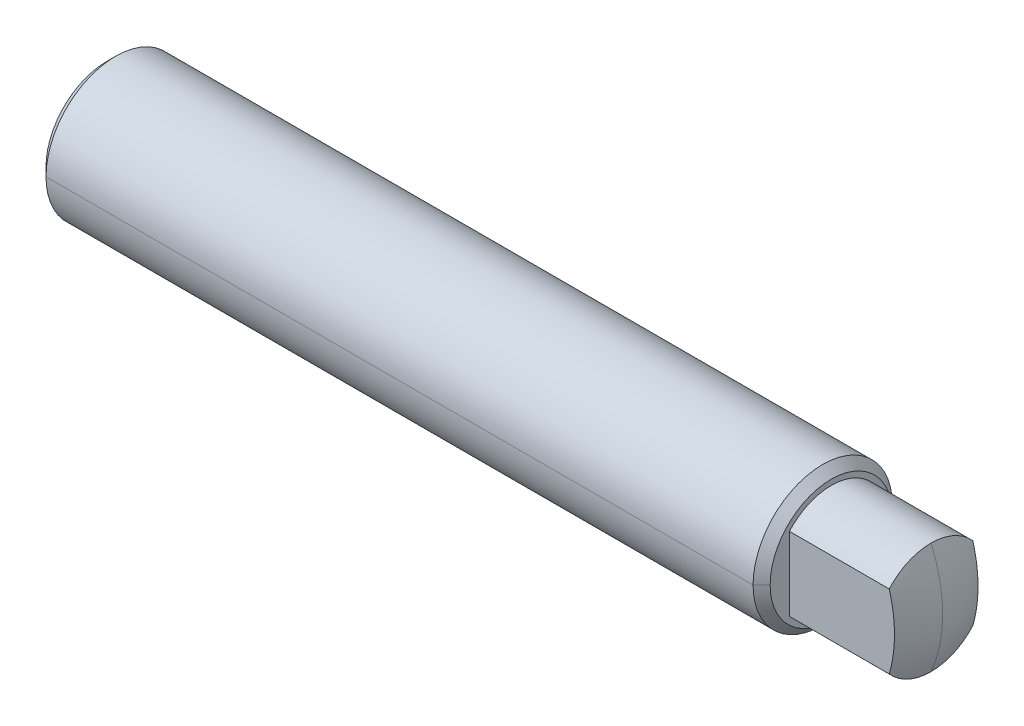
ISO-10303-21;
HEADER;
FILE_DESCRIPTION(('STEP AP214'),'2;1');
FILE_NAME('part.step','',(''),(''),'','','');
FILE_SCHEMA(('AUTOMOTIVE_DESIGN { 1 0 10303 214 1 1 1 1 }'));
ENDSEC;
DATA;
#1=APPLICATION_CONTEXT('core data for automotive mechanical design processes');
#2=APPLICATION_PROTOCOL_DEFINITION('international standard','automotive_design',2000,#1);
#3=PRODUCT_CONTEXT('',#1,'mechanical');
#4=PRODUCT('Part','Part','',(#3));
#5=PRODUCT_RELATED_PRODUCT_CATEGORY('part','',(#4));
#6=PRODUCT_DEFINITION_FORMATION('','',#4);
#7=PRODUCT_DEFINITION_CONTEXT('part definition',#1,'design');
#8=PRODUCT_DEFINITION('design','',#6,#7);
#9=PRODUCT_DEFINITION_SHAPE('','',#8);
#10=(LENGTH_UNIT() NAMED_UNIT(*) SI_UNIT(.MILLI.,.METRE.));
#11=(NAMED_UNIT(*) PLANE_ANGLE_UNIT() SI_UNIT($,.RADIAN.));
#12=(NAMED_UNIT(*) SI_UNIT($,.STERADIAN.) SOLID_ANGLE_UNIT());
#13=UNCERTAINTY_MEASURE_WITH_UNIT(LENGTH_MEASURE(1.E-05),#10,'distance_accuracy_value','');
#14=(GEOMETRIC_REPRESENTATION_CONTEXT(3) GLOBAL_UNCERTAINTY_ASSIGNED_CONTEXT((#13)) GLOBAL_UNIT_ASSIGNED_CONTEXT((#10,
#11,#12)) REPRESENTATION_CONTEXT('',''));
#15=CARTESIAN_POINT('',(0.,0.,0.));
#16=DIRECTION('',(0.,0.,1.));
#17=DIRECTION('',(1.,0.,0.));
#18=AXIS2_PLACEMENT_3D('',#15,#16,#17);
#19=CARTESIAN_POINT('',(60.,0.,0.));
#20=DIRECTION('',(1.,0.,0.));
#21=DIRECTION('',(0.,1.,0.));
#22=AXIS2_PLACEMENT_3D('',#19,#20,#21);
#23=CYLINDRICAL_SURFACE('',#22,4.);
#24=DIRECTION('',(-1.,0.,0.));
#25=VECTOR('',#24,1.);
#26=CARTESIAN_POINT('',(60.,-2.64575131106459,-3.));
#27=LINE('',#26,#25);
#28=CARTESIAN_POINT('',(59.165151389912,-2.64575131106579,-3.));
#29=VERTEX_POINT('',#28);
#30=CARTESIAN_POINT('',(52.,-2.64575131106459,-3.));
#31=VERTEX_POINT('',#30);
#32=EDGE_CURVE('E11',#29,#31,#27,.T.);
#33=ORIENTED_EDGE('',*,*,#32,.F.);
#34=CARTESIAN_POINT('',(59.165151389912,0.,0.));
#35=DIRECTION('',(1.,0.,0.));
#36=DIRECTION('',(0.,0.,-1.));
#37=AXIS2_PLACEMENT_3D('',#34,#35,#36);
#38=CIRCLE('',#37,4.);
#39=CARTESIAN_POINT('',(59.1651513899125,-4.00000000000056,0.));
#40=VERTEX_POINT('',#39);
#41=EDGE_CURVE('E24',#40,#29,#38,.T.);
#42=ORIENTED_EDGE('',*,*,#41,.F.);
#43=CARTESIAN_POINT('',(59.165151389912,0.,0.));
#44=DIRECTION('',(1.,0.,0.));
#45=DIRECTION('',(0.,0.,-1.));
#46=AXIS2_PLACEMENT_3D('',#43,#44,#45);
#47=CIRCLE('',#46,4.);
#48=CARTESIAN_POINT('',(59.165151389912,-2.64575131106579,3.));
#49=VERTEX_POINT('',#48);
#50=EDGE_CURVE('E155',#49,#40,#47,.T.);
#51=ORIENTED_EDGE('',*,*,#50,.F.);
#52=DIRECTION('',(1.,0.,0.));
#53=VECTOR('',#52,1.);
#54=CARTESIAN_POINT('',(60.,-2.64575131106459,3.));
#55=LINE('',#54,#53);
#56=CARTESIAN_POINT('',(52.,-2.64575131106459,3.));
#57=VERTEX_POINT('',#56);
#58=EDGE_CURVE('E411',#57,#49,#55,.T.);
#59=ORIENTED_EDGE('',*,*,#58,.F.);
#60=CARTESIAN_POINT('',(52.,0.,0.));
#61=DIRECTION('',(1.,0.,0.));
#62=DIRECTION('',(0.,0.,-1.));
#63=AXIS2_PLACEMENT_3D('',#60,#61,#62);
#64=CIRCLE('',#63,4.);
#65=EDGE_CURVE('E407',#57,#31,#64,.T.);
#66=ORIENTED_EDGE('',*,*,#65,.T.);
#67=EDGE_LOOP('',(#33,#42,#51,#59,#66));
#68=FACE_BOUND('',#67,.T.);
#69=ADVANCED_FACE('F16',(#68),#23,.T.);
#70=CARTESIAN_POINT('',(52.,4.3865,0.));
#71=DIRECTION('',(-1.,0.,0.));
#72=DIRECTION('',(0.,0.,1.));
#73=AXIS2_PLACEMENT_3D('',#70,#71,#72);
#74=PLANE('',#73);
#75=CARTESIAN_POINT('',(52.,0.,0.));
#76=DIRECTION('',(1.,0.,0.));
#77=DIRECTION('',(0.,0.,-1.));
#78=AXIS2_PLACEMENT_3D('',#75,#76,#77);
#79=CIRCLE('',#78,4.);
#80=CARTESIAN_POINT('',(52.,2.64575131106459,-3.));
#81=VERTEX_POINT('',#80);
#82=CARTESIAN_POINT('',(52.,2.64575131106459,3.));
#83=VERTEX_POINT('',#82);
#84=EDGE_CURVE('E402',#81,#83,#79,.T.);
#85=ORIENTED_EDGE('',*,*,#84,.F.);
#86=DIRECTION('',(0.,1.,0.));
#87=VECTOR('',#86,1.);
#88=CARTESIAN_POINT('',(52.,-10.,-3.));
#89=LINE('',#88,#87);
#90=EDGE_CURVE('E397',#31,#81,#89,.T.);
#91=ORIENTED_EDGE('',*,*,#90,.F.);
#92=ORIENTED_EDGE('',*,*,#65,.F.);
#93=DIRECTION('',(0.,-1.,0.));
#94=VECTOR('',#93,1.);
#95=CARTESIAN_POINT('',(52.,10.,3.));
#96=LINE('',#95,#94);
#97=EDGE_CURVE('E392',#83,#57,#96,.T.);
#98=ORIENTED_EDGE('',*,*,#97,.F.);
#99=EDGE_LOOP('',(#85,#91,#92,#98));
#100=FACE_BOUND('',#99,.T.);
#101=CARTESIAN_POINT('',(52.,0.,0.));
#102=DIRECTION('',(1.,0.,0.));
#103=DIRECTION('',(0.,0.,-1.));
#104=AXIS2_PLACEMENT_3D('',#101,#102,#103);
#105=CIRCLE('',#104,4.3865);
#106=CARTESIAN_POINT('',(52.,0.,-4.3865));
#107=VERTEX_POINT('',#106);
#108=CARTESIAN_POINT('',(52.,0.,4.3865));
#109=VERTEX_POINT('',#108);
#110=EDGE_CURVE('E388',#107,#109,#105,.T.);
#111=ORIENTED_EDGE('',*,*,#110,.T.);
#112=CARTESIAN_POINT('',(52.,0.,0.));
#113=DIRECTION('',(1.,0.,0.));
#114=DIRECTION('',(0.,0.,-1.));
#115=AXIS2_PLACEMENT_3D('',#112,#113,#114);
#116=CIRCLE('',#115,4.3865);
#117=EDGE_CURVE('E384',#109,#107,#116,.T.);
#118=ORIENTED_EDGE('',*,*,#117,.T.);
#119=EDGE_LOOP('',(#111,#118));
#120=FACE_BOUND('',#119,.T.);
#121=ADVANCED_FACE('F434',(#100,#120),#74,.F.);
#122=CARTESIAN_POINT('',(51.3865,0.,0.));
#123=DIRECTION('',(-1.,0.,0.));
#124=DIRECTION('',(0.,1.,0.));
#125=AXIS2_PLACEMENT_3D('',#122,#123,#124);
#126=CONICAL_SURFACE('',#125,5.,0.785398163397441);
#127=DIRECTION('',(-0.707106781186555,0.,-0.70710678118654));
#128=VECTOR('',#127,1.);
#129=CARTESIAN_POINT('',(52.,0.,-4.3865));
#130=LINE('',#129,#128);
#131=CARTESIAN_POINT('',(51.3865,0.,-5.));
#132=VERTEX_POINT('',#131);
#133=EDGE_CURVE('E379',#107,#132,#130,.T.);
#134=ORIENTED_EDGE('',*,*,#133,.F.);
#135=ORIENTED_EDGE('',*,*,#117,.F.);
#136=DIRECTION('',(-0.707106781186555,0.,0.70710678118654));
#137=VECTOR('',#136,1.);
#138=CARTESIAN_POINT('',(52.,0.,4.3865));
#139=LINE('',#138,#137);
#140=CARTESIAN_POINT('',(51.3865,0.,5.));
#141=VERTEX_POINT('',#140);
#142=EDGE_CURVE('E375',#109,#141,#139,.T.);
#143=ORIENTED_EDGE('',*,*,#142,.T.);
#144=CARTESIAN_POINT('',(51.3865,0.,0.));
#145=DIRECTION('',(1.,0.,0.));
#146=DIRECTION('',(0.,0.,-1.));
#147=AXIS2_PLACEMENT_3D('',#144,#145,#146);
#148=CIRCLE('',#147,5.);
#149=EDGE_CURVE('E371',#141,#132,#148,.T.);
#150=ORIENTED_EDGE('',*,*,#149,.T.);
#151=EDGE_LOOP('',(#134,#135,#143,#150));
#152=FACE_BOUND('',#151,.T.);
#153=ADVANCED_FACE('F437',(#152),#126,.T.);
#154=CARTESIAN_POINT('',(60.,0.,0.));
#155=DIRECTION('',(1.,0.,0.));
#156=DIRECTION('',(0.,1.,0.));
#157=AXIS2_PLACEMENT_3D('',#154,#155,#156);
#158=CYLINDRICAL_SURFACE('',#157,5.);
#159=DIRECTION('',(1.,0.,0.));
#160=VECTOR('',#159,1.);
#161=CARTESIAN_POINT('',(0.613500000000002,0.,5.));
#162=LINE('',#161,#160);
#163=CARTESIAN_POINT('',(0.613500000000001,0.,5.));
#164=VERTEX_POINT('',#163);
#165=EDGE_CURVE('E366',#164,#141,#162,.T.);
#166=ORIENTED_EDGE('',*,*,#165,.F.);
#167=CARTESIAN_POINT('',(0.6135,0.,0.));
#168=DIRECTION('',(1.,0.,0.));
#169=DIRECTION('',(0.,0.,-1.));
#170=AXIS2_PLACEMENT_3D('',#167,#168,#169);
#171=CIRCLE('',#170,5.);
#172=CARTESIAN_POINT('',(0.6135,0.,-5.));
#173=VERTEX_POINT('',#172);
#174=EDGE_CURVE('E362',#164,#173,#171,.T.);
#175=ORIENTED_EDGE('',*,*,#174,.T.);
#176=DIRECTION('',(1.,0.,0.));
#177=VECTOR('',#176,1.);
#178=CARTESIAN_POINT('',(0.613500000000002,0.,-5.));
#179=LINE('',#178,#177);
#180=EDGE_CURVE('E357',#173,#132,#179,.T.);
#181=ORIENTED_EDGE('',*,*,#180,.T.);
#182=ORIENTED_EDGE('',*,*,#149,.F.);
#183=EDGE_LOOP('',(#166,#175,#181,#182));
#184=FACE_BOUND('',#183,.T.);
#185=ADVANCED_FACE('F449',(#184),#158,.T.);
#186=CARTESIAN_POINT('',(60.,0.,0.));
#187=DIRECTION('',(1.,0.,0.));
#188=DIRECTION('',(0.,-1.,0.));
#189=AXIS2_PLACEMENT_3D('',#186,#187,#188);
#190=CYLINDRICAL_SURFACE('',#189,5.);
#191=ORIENTED_EDGE('',*,*,#165,.T.);
#192=CARTESIAN_POINT('',(51.3865,0.,0.));
#193=DIRECTION('',(1.,0.,0.));
#194=DIRECTION('',(0.,0.,-1.));
#195=AXIS2_PLACEMENT_3D('',#192,#193,#194);
#196=CIRCLE('',#195,5.);
#197=EDGE_CURVE('E352',#132,#141,#196,.T.);
#198=ORIENTED_EDGE('',*,*,#197,.F.);
#199=ORIENTED_EDGE('',*,*,#180,.F.);
#200=CARTESIAN_POINT('',(0.6135,0.,0.));
#201=DIRECTION('',(1.,0.,0.));
#202=DIRECTION('',(0.,0.,-1.));
#203=AXIS2_PLACEMENT_3D('',#200,#201,#202);
#204=CIRCLE('',#203,5.);
#205=EDGE_CURVE('E347',#173,#164,#204,.T.);
#206=ORIENTED_EDGE('',*,*,#205,.T.);
#207=EDGE_LOOP('',(#191,#198,#199,#206));
#208=FACE_BOUND('',#207,.T.);
#209=ADVANCED_FACE('F452',(#208),#190,.T.);
#210=CARTESIAN_POINT('',(0.,0.,0.));
#211=DIRECTION('',(1.,0.,0.));
#212=DIRECTION('',(0.,-1.,0.));
#213=AXIS2_PLACEMENT_3D('',#210,#211,#212);
#214=CONICAL_SURFACE('',#213,4.3865,0.785398163397446);
#215=DIRECTION('',(0.707106781186549,0.,0.707106781186546));
#216=VECTOR('',#215,1.);
#217=CARTESIAN_POINT('',(0.,0.,4.3865));
#218=LINE('',#217,#216);
#219=CARTESIAN_POINT('',(0.,0.,4.3865));
#220=VERTEX_POINT('',#219);
#221=EDGE_CURVE('E342',#220,#164,#218,.T.);
#222=ORIENTED_EDGE('',*,*,#221,.T.);
#223=ORIENTED_EDGE('',*,*,#205,.F.);
#224=DIRECTION('',(0.707106781186549,0.,-0.707106781186546));
#225=VECTOR('',#224,1.);
#226=CARTESIAN_POINT('',(0.,0.,-4.3865));
#227=LINE('',#226,#225);
#228=CARTESIAN_POINT('',(0.,0.,-4.3865));
#229=VERTEX_POINT('',#228);
#230=EDGE_CURVE('E337',#229,#173,#227,.T.);
#231=ORIENTED_EDGE('',*,*,#230,.F.);
#232=CARTESIAN_POINT('',(0.,0.,0.));
#233=DIRECTION('',(1.,0.,0.));
#234=DIRECTION('',(0.,0.,-1.));
#235=AXIS2_PLACEMENT_3D('',#232,#233,#234);
#236=CIRCLE('',#235,4.3865);
#237=EDGE_CURVE('E333',#229,#220,#236,.T.);
#238=ORIENTED_EDGE('',*,*,#237,.T.);
#239=EDGE_LOOP('',(#222,#223,#231,#238));
#240=FACE_BOUND('',#239,.T.);
#241=ADVANCED_FACE('F456',(#240),#214,.T.);
#242=CARTESIAN_POINT('',(0.,0.,0.));
#243=DIRECTION('',(1.,0.,0.));
#244=DIRECTION('',(0.,0.,-1.));
#245=AXIS2_PLACEMENT_3D('',#242,#243,#244);
#246=PLANE('',#245);
#247=CARTESIAN_POINT('',(0.,0.,0.));
#248=DIRECTION('',(1.,0.,0.));
#249=DIRECTION('',(0.,0.,-1.));
#250=AXIS2_PLACEMENT_3D('',#247,#248,#249);
#251=CIRCLE('',#250,4.3865);
#252=EDGE_CURVE('E328',#220,#229,#251,.T.);
#253=ORIENTED_EDGE('',*,*,#252,.F.);
#254=ORIENTED_EDGE('',*,*,#237,.F.);
#255=EDGE_LOOP('',(#253,#254));
#256=FACE_BOUND('',#255,.T.);
#257=DIRECTION('',(0.,0.499999999999983,-0.866025403784448));
#258=VECTOR('',#257,1.);
#259=CARTESIAN_POINT('',(0.,-2.8867513459481,0.));
#260=LINE('',#259,#258);
#261=CARTESIAN_POINT('',(0.,-2.8867513459481,0.));
#262=VERTEX_POINT('',#261);
#263=CARTESIAN_POINT('',(0.,-1.4433756729741,-2.5));
#264=VERTEX_POINT('',#263);
#265=EDGE_CURVE('E324',#262,#264,#260,.T.);
#266=ORIENTED_EDGE('',*,*,#265,.T.);
#267=DIRECTION('',(0.,1.,0.));
#268=VECTOR('',#267,1.);
#269=CARTESIAN_POINT('',(0.,-1.4433756729741,-2.5));
#270=LINE('',#269,#268);
#271=CARTESIAN_POINT('',(0.,1.4433756729741,-2.5));
#272=VERTEX_POINT('',#271);
#273=EDGE_CURVE('E320',#264,#272,#270,.T.);
#274=ORIENTED_EDGE('',*,*,#273,.T.);
#275=DIRECTION('',(0.,0.499999999999983,0.866025403784448));
#276=VECTOR('',#275,1.);
#277=CARTESIAN_POINT('',(0.,1.4433756729741,-2.5));
#278=LINE('',#277,#276);
#279=CARTESIAN_POINT('',(0.,2.8867513459481,0.));
#280=VERTEX_POINT('',#279);
#281=EDGE_CURVE('E316',#272,#280,#278,.T.);
#282=ORIENTED_EDGE('',*,*,#281,.T.);
#283=DIRECTION('',(0.,-0.499999999999983,0.866025403784448));
#284=VECTOR('',#283,1.);
#285=CARTESIAN_POINT('',(0.,2.8867513459481,0.));
#286=LINE('',#285,#284);
#287=CARTESIAN_POINT('',(0.,1.4433756729741,2.5));
#288=VERTEX_POINT('',#287);
#289=EDGE_CURVE('E312',#280,#288,#286,.T.);
#290=ORIENTED_EDGE('',*,*,#289,.T.);
#291=DIRECTION('',(0.,-1.,0.));
#292=VECTOR('',#291,1.);
#293=CARTESIAN_POINT('',(0.,1.4433756729741,2.5));
#294=LINE('',#293,#292);
#295=CARTESIAN_POINT('',(0.,-1.4433756729741,2.5));
#296=VERTEX_POINT('',#295);
#297=EDGE_CURVE('E308',#288,#296,#294,.T.);
#298=ORIENTED_EDGE('',*,*,#297,.T.);
#299=DIRECTION('',(0.,-0.499999999999983,-0.866025403784448));
#300=VECTOR('',#299,1.);
#301=CARTESIAN_POINT('',(0.,-1.4433756729741,2.5));
#302=LINE('',#301,#300);
#303=EDGE_CURVE('E304',#296,#262,#302,.T.);
#304=ORIENTED_EDGE('',*,*,#303,.T.);
#305=EDGE_LOOP('',(#266,#274,#282,#290,#298,#304));
#306=FACE_BOUND('',#305,.T.);
#307=ADVANCED_FACE('F462',(#256,#306),#246,.F.);
#308=CARTESIAN_POINT('',(5.,-1.4433756729741,2.5));
#309=DIRECTION('',(0.,0.866025403784448,-0.499999999999983));
#310=DIRECTION('',(0.,0.499999999999983,0.866025403784448));
#311=AXIS2_PLACEMENT_3D('',#308,#309,#310);
#312=PLANE('',#311);
#313=ORIENTED_EDGE('',*,*,#303,.F.);
#314=DIRECTION('',(-1.,0.,0.));
#315=VECTOR('',#314,1.);
#316=CARTESIAN_POINT('',(5.,-1.4433756729741,2.5));
#317=LINE('',#316,#315);
#318=CARTESIAN_POINT('',(5.,-1.4433756729741,2.5));
#319=VERTEX_POINT('',#318);
#320=EDGE_CURVE('E299',#319,#296,#317,.T.);
#321=ORIENTED_EDGE('',*,*,#320,.F.);
#322=DIRECTION('',(0.,-0.499999999999983,-0.866025403784448));
#323=VECTOR('',#322,1.);
#324=CARTESIAN_POINT('',(5.,-1.4433756729741,2.5));
#325=LINE('',#324,#323);
#326=CARTESIAN_POINT('',(5.,-2.16506350946112,1.24999999999996));
#327=VERTEX_POINT('',#326);
#328=EDGE_CURVE('E295',#319,#327,#325,.T.);
#329=ORIENTED_EDGE('',*,*,#328,.T.);
#330=DIRECTION('',(0.,-0.499999999999983,-0.866025403784448));
#331=VECTOR('',#330,1.);
#332=CARTESIAN_POINT('',(5.,-1.4433756729741,2.5));
#333=LINE('',#332,#331);
#334=CARTESIAN_POINT('',(5.,-2.8867513459481,0.));
#335=VERTEX_POINT('',#334);
#336=EDGE_CURVE('E291',#327,#335,#333,.T.);
#337=ORIENTED_EDGE('',*,*,#336,.T.);
#338=DIRECTION('',(-1.,0.,0.));
#339=VECTOR('',#338,1.);
#340=CARTESIAN_POINT('',(5.,-2.8867513459481,0.));
#341=LINE('',#340,#339);
#342=EDGE_CURVE('E286',#335,#262,#341,.T.);
#343=ORIENTED_EDGE('',*,*,#342,.T.);
#344=EDGE_LOOP('',(#313,#321,#329,#337,#343));
#345=FACE_BOUND('',#344,.T.);
#346=ADVANCED_FACE('F465',(#345),#312,.T.);
#347=CARTESIAN_POINT('',(5.,-2.8867513459481,0.));
#348=DIRECTION('',(0.,0.866025403784448,0.499999999999983));
#349=DIRECTION('',(0.,-0.499999999999983,0.866025403784448));
#350=AXIS2_PLACEMENT_3D('',#347,#348,#349);
#351=PLANE('',#350);
#352=ORIENTED_EDGE('',*,*,#265,.F.);
#353=ORIENTED_EDGE('',*,*,#342,.F.);
#354=DIRECTION('',(0.,0.499999999999983,-0.866025403784448));
#355=VECTOR('',#354,1.);
#356=CARTESIAN_POINT('',(5.,-2.8867513459481,0.));
#357=LINE('',#356,#355);
#358=CARTESIAN_POINT('',(5.,-2.16506350946112,-1.24999999999996));
#359=VERTEX_POINT('',#358);
#360=EDGE_CURVE('E282',#335,#359,#357,.T.);
#361=ORIENTED_EDGE('',*,*,#360,.T.);
#362=DIRECTION('',(0.,0.499999999999983,-0.866025403784448));
#363=VECTOR('',#362,1.);
#364=CARTESIAN_POINT('',(5.,-2.8867513459481,0.));
#365=LINE('',#364,#363);
#366=CARTESIAN_POINT('',(5.,-1.4433756729741,-2.5));
#367=VERTEX_POINT('',#366);
#368=EDGE_CURVE('E278',#359,#367,#365,.T.);
#369=ORIENTED_EDGE('',*,*,#368,.T.);
#370=DIRECTION('',(-1.,0.,0.));
#371=VECTOR('',#370,1.);
#372=CARTESIAN_POINT('',(5.,-1.4433756729741,-2.5));
#373=LINE('',#372,#371);
#374=EDGE_CURVE('E273',#367,#264,#373,.T.);
#375=ORIENTED_EDGE('',*,*,#374,.T.);
#376=EDGE_LOOP('',(#352,#353,#361,#369,#375));
#377=FACE_BOUND('',#376,.T.);
#378=ADVANCED_FACE('F473',(#377),#351,.T.);
#379=CARTESIAN_POINT('',(5.,-1.4433756729741,-2.5));
#380=DIRECTION('',(0.,0.,1.));
#381=DIRECTION('',(1.,0.,0.));
#382=AXIS2_PLACEMENT_3D('',#379,#380,#381);
#383=PLANE('',#382);
#384=ORIENTED_EDGE('',*,*,#273,.F.);
#385=ORIENTED_EDGE('',*,*,#374,.F.);
#386=DIRECTION('',(0.,1.,0.));
#387=VECTOR('',#386,1.);
#388=CARTESIAN_POINT('',(5.,-1.4433756729741,-2.5));
#389=LINE('',#388,#387);
#390=CARTESIAN_POINT('',(5.,0.,-2.5));
#391=VERTEX_POINT('',#390);
#392=EDGE_CURVE('E269',#367,#391,#389,.T.);
#393=ORIENTED_EDGE('',*,*,#392,.T.);
#394=DIRECTION('',(0.,1.,0.));
#395=VECTOR('',#394,1.);
#396=CARTESIAN_POINT('',(5.,-1.4433756729741,-2.5));
#397=LINE('',#396,#395);
#398=CARTESIAN_POINT('',(5.,1.4433756729741,-2.5));
#399=VERTEX_POINT('',#398);
#400=EDGE_CURVE('E265',#391,#399,#397,.T.);
#401=ORIENTED_EDGE('',*,*,#400,.T.);
#402=DIRECTION('',(-1.,0.,0.));
#403=VECTOR('',#402,1.);
#404=CARTESIAN_POINT('',(5.,1.4433756729741,-2.5));
#405=LINE('',#404,#403);
#406=EDGE_CURVE('E260',#399,#272,#405,.T.);
#407=ORIENTED_EDGE('',*,*,#406,.T.);
#408=EDGE_LOOP('',(#384,#385,#393,#401,#407));
#409=FACE_BOUND('',#408,.T.);
#410=ADVANCED_FACE('F477',(#409),#383,.T.);
#411=CARTESIAN_POINT('',(5.,1.4433756729741,-2.5));
#412=DIRECTION('',(0.,-0.866025403784448,0.499999999999983));
#413=DIRECTION('',(0.,-0.499999999999983,-0.866025403784448));
#414=AXIS2_PLACEMENT_3D('',#411,#412,#413);
#415=PLANE('',#414);
#416=ORIENTED_EDGE('',*,*,#281,.F.);
#417=ORIENTED_EDGE('',*,*,#406,.F.);
#418=DIRECTION('',(0.,0.499999999999983,0.866025403784448));
#419=VECTOR('',#418,1.);
#420=CARTESIAN_POINT('',(5.,1.4433756729741,-2.5));
#421=LINE('',#420,#419);
#422=CARTESIAN_POINT('',(5.,2.16506350946112,-1.24999999999996));
#423=VERTEX_POINT('',#422);
#424=EDGE_CURVE('E256',#399,#423,#421,.T.);
#425=ORIENTED_EDGE('',*,*,#424,.T.);
#426=DIRECTION('',(0.,0.499999999999983,0.866025403784448));
#427=VECTOR('',#426,1.);
#428=CARTESIAN_POINT('',(5.,1.4433756729741,-2.5));
#429=LINE('',#428,#427);
#430=CARTESIAN_POINT('',(5.,2.8867513459481,0.));
#431=VERTEX_POINT('',#430);
#432=EDGE_CURVE('E252',#423,#431,#429,.T.);
#433=ORIENTED_EDGE('',*,*,#432,.T.);
#434=DIRECTION('',(-1.,0.,0.));
#435=VECTOR('',#434,1.);
#436=CARTESIAN_POINT('',(5.,2.8867513459481,0.));
#437=LINE('',#436,#435);
#438=EDGE_CURVE('E247',#431,#280,#437,.T.);
#439=ORIENTED_EDGE('',*,*,#438,.T.);
#440=EDGE_LOOP('',(#416,#417,#425,#433,#439));
#441=FACE_BOUND('',#440,.T.);
#442=ADVANCED_FACE('F483',(#441),#415,.T.);
#443=CARTESIAN_POINT('',(5.,2.8867513459481,0.));
#444=DIRECTION('',(0.,-0.866025403784448,-0.499999999999983));
#445=DIRECTION('',(0.,0.499999999999983,-0.866025403784448));
#446=AXIS2_PLACEMENT_3D('',#443,#444,#445);
#447=PLANE('',#446);
#448=ORIENTED_EDGE('',*,*,#289,.F.);
#449=ORIENTED_EDGE('',*,*,#438,.F.);
#450=DIRECTION('',(0.,-0.499999999999983,0.866025403784448));
#451=VECTOR('',#450,1.);
#452=CARTESIAN_POINT('',(5.,2.8867513459481,0.));
#453=LINE('',#452,#451);
#454=CARTESIAN_POINT('',(5.,2.16506350946112,1.24999999999996));
#455=VERTEX_POINT('',#454);
#456=EDGE_CURVE('E243',#431,#455,#453,.T.);
#457=ORIENTED_EDGE('',*,*,#456,.T.);
#458=DIRECTION('',(0.,-0.499999999999983,0.866025403784448));
#459=VECTOR('',#458,1.);
#460=CARTESIAN_POINT('',(5.,2.8867513459481,0.));
#461=LINE('',#460,#459);
#462=CARTESIAN_POINT('',(5.,1.4433756729741,2.5));
#463=VERTEX_POINT('',#462);
#464=EDGE_CURVE('E239',#455,#463,#461,.T.);
#465=ORIENTED_EDGE('',*,*,#464,.T.);
#466=DIRECTION('',(-1.,0.,0.));
#467=VECTOR('',#466,1.);
#468=CARTESIAN_POINT('',(5.,1.4433756729741,2.5));
#469=LINE('',#468,#467);
#470=EDGE_CURVE('E234',#463,#288,#469,.T.);
#471=ORIENTED_EDGE('',*,*,#470,.T.);
#472=EDGE_LOOP('',(#448,#449,#457,#465,#471));
#473=FACE_BOUND('',#472,.T.);
#474=ADVANCED_FACE('F489',(#473),#447,.T.);
#475=CARTESIAN_POINT('',(5.,1.4433756729741,2.5));
#476=DIRECTION('',(0.,0.,-1.));
#477=DIRECTION('',(-1.,0.,0.));
#478=AXIS2_PLACEMENT_3D('',#475,#476,#477);
#479=PLANE('',#478);
#480=ORIENTED_EDGE('',*,*,#297,.F.);
#481=ORIENTED_EDGE('',*,*,#470,.F.);
#482=DIRECTION('',(0.,-1.,0.));
#483=VECTOR('',#482,1.);
#484=CARTESIAN_POINT('',(5.,1.4433756729741,2.5));
#485=LINE('',#484,#483);
#486=CARTESIAN_POINT('',(5.,0.,2.5));
#487=VERTEX_POINT('',#486);
#488=EDGE_CURVE('E230',#463,#487,#485,.T.);
#489=ORIENTED_EDGE('',*,*,#488,.T.);
#490=DIRECTION('',(0.,-1.,0.));
#491=VECTOR('',#490,1.);
#492=CARTESIAN_POINT('',(5.,1.4433756729741,2.5));
#493=LINE('',#492,#491);
#494=EDGE_CURVE('E225',#487,#319,#493,.T.);
#495=ORIENTED_EDGE('',*,*,#494,.T.);
#496=ORIENTED_EDGE('',*,*,#320,.T.);
#497=EDGE_LOOP('',(#480,#481,#489,#495,#496));
#498=FACE_BOUND('',#497,.T.);
#499=ADVANCED_FACE('F493',(#498),#479,.T.);
#500=CARTESIAN_POINT('',(5.,0.,0.));
#501=DIRECTION('',(1.,0.,0.));
#502=DIRECTION('',(0.,0.,-1.));
#503=AXIS2_PLACEMENT_3D('',#500,#501,#502);
#504=PLANE('',#503);
#505=CARTESIAN_POINT('',(5.,0.,0.));
#506=DIRECTION('',(1.,0.,0.));
#507=DIRECTION('',(0.,0.,-1.));
#508=AXIS2_PLACEMENT_3D('',#505,#506,#507);
#509=CIRCLE('',#508,2.5);
#510=EDGE_CURVE('E220',#487,#327,#509,.T.);
#511=ORIENTED_EDGE('',*,*,#510,.T.);
#512=ORIENTED_EDGE('',*,*,#328,.F.);
#513=ORIENTED_EDGE('',*,*,#494,.F.);
#514=EDGE_LOOP('',(#511,#512,#513));
#515=FACE_BOUND('',#514,.T.);
#516=ADVANCED_FACE('F594',(#515),#504,.F.);
#517=CARTESIAN_POINT('',(5.,0.,0.));
#518=DIRECTION('',(-1.,0.,0.));
#519=DIRECTION('',(0.,1.,0.));
#520=AXIS2_PLACEMENT_3D('',#517,#518,#519);
#521=CONICAL_SURFACE('',#520,2.5,1.04719755119659);
#522=DIRECTION('',(-0.500000000000009,0.,-0.866025403784433));
#523=VECTOR('',#522,1.);
#524=CARTESIAN_POINT('',(6.4433756729741,0.,0.));
#525=LINE('',#524,#523);
#526=CARTESIAN_POINT('',(6.4433756729741,0.,0.));
#527=VERTEX_POINT('',#526);
#528=EDGE_CURVE('E215',#527,#391,#525,.T.);
#529=ORIENTED_EDGE('',*,*,#528,.T.);
#530=CARTESIAN_POINT('',(5.,0.,0.));
#531=DIRECTION('',(1.,0.,0.));
#532=DIRECTION('',(0.,0.,-1.));
#533=AXIS2_PLACEMENT_3D('',#530,#531,#532);
#534=CIRCLE('',#533,2.5);
#535=EDGE_CURVE('E210',#359,#391,#534,.T.);
#536=ORIENTED_EDGE('',*,*,#535,.F.);
#537=CARTESIAN_POINT('',(5.,0.,0.));
#538=DIRECTION('',(1.,0.,0.));
#539=DIRECTION('',(0.,0.,-1.));
#540=AXIS2_PLACEMENT_3D('',#537,#538,#539);
#541=CIRCLE('',#540,2.5);
#542=EDGE_CURVE('E205',#327,#359,#541,.T.);
#543=ORIENTED_EDGE('',*,*,#542,.F.);
#544=ORIENTED_EDGE('',*,*,#510,.F.);
#545=DIRECTION('',(-0.500000000000009,0.,0.866025403784433));
#546=VECTOR('',#545,1.);
#547=CARTESIAN_POINT('',(6.4433756729741,0.,0.));
#548=LINE('',#547,#546);
#549=EDGE_CURVE('E200',#527,#487,#548,.T.);
#550=ORIENTED_EDGE('',*,*,#549,.F.);
#551=EDGE_LOOP('',(#529,#536,#543,#544,#550));
#552=FACE_BOUND('',#551,.T.);
#553=ADVANCED_FACE('F503',(#552),#521,.F.);
#554=CARTESIAN_POINT('',(5.,0.,0.));
#555=DIRECTION('',(-1.,0.,0.));
#556=DIRECTION('',(0.,-1.,0.));
#557=AXIS2_PLACEMENT_3D('',#554,#555,#556);
#558=CONICAL_SURFACE('',#557,2.5,1.04719755119659);
#559=ORIENTED_EDGE('',*,*,#549,.T.);
#560=CARTESIAN_POINT('',(5.,0.,0.));
#561=DIRECTION('',(1.,0.,0.));
#562=DIRECTION('',(0.,0.,-1.));
#563=AXIS2_PLACEMENT_3D('',#560,#561,#562);
#564=CIRCLE('',#563,2.5);
#565=EDGE_CURVE('E195',#455,#487,#564,.T.);
#566=ORIENTED_EDGE('',*,*,#565,.F.);
#567=CARTESIAN_POINT('',(5.,0.,0.));
#568=DIRECTION('',(1.,0.,0.));
#569=DIRECTION('',(0.,0.,-1.));
#570=AXIS2_PLACEMENT_3D('',#567,#568,#569);
#571=CIRCLE('',#570,2.5);
#572=EDGE_CURVE('E190',#423,#455,#571,.T.);
#573=ORIENTED_EDGE('',*,*,#572,.F.);
#574=CARTESIAN_POINT('',(5.,0.,0.));
#575=DIRECTION('',(1.,0.,0.));
#576=DIRECTION('',(0.,0.,-1.));
#577=AXIS2_PLACEMENT_3D('',#574,#575,#576);
#578=CIRCLE('',#577,2.5);
#579=EDGE_CURVE('E185',#391,#423,#578,.T.);
#580=ORIENTED_EDGE('',*,*,#579,.F.);
#581=ORIENTED_EDGE('',*,*,#528,.F.);
#582=EDGE_LOOP('',(#559,#566,#573,#580,#581));
#583=FACE_BOUND('',#582,.T.);
#584=ADVANCED_FACE('F608',(#583),#558,.F.);
#585=CARTESIAN_POINT('',(5.,0.,0.));
#586=DIRECTION('',(1.,0.,0.));
#587=DIRECTION('',(0.,0.,-1.));
#588=AXIS2_PLACEMENT_3D('',#585,#586,#587);
#589=PLANE('',#588);
#590=ORIENTED_EDGE('',*,*,#579,.T.);
#591=ORIENTED_EDGE('',*,*,#424,.F.);
#592=ORIENTED_EDGE('',*,*,#400,.F.);
#593=EDGE_LOOP('',(#590,#591,#592));
#594=FACE_BOUND('',#593,.T.);
#595=ADVANCED_FACE('F615',(#594),#589,.F.);
#596=CARTESIAN_POINT('',(5.,0.,0.));
#597=DIRECTION('',(1.,0.,0.));
#598=DIRECTION('',(0.,0.,-1.));
#599=AXIS2_PLACEMENT_3D('',#596,#597,#598);
#600=PLANE('',#599);
#601=ORIENTED_EDGE('',*,*,#432,.F.);
#602=ORIENTED_EDGE('',*,*,#572,.T.);
#603=ORIENTED_EDGE('',*,*,#456,.F.);
#604=EDGE_LOOP('',(#601,#602,#603));
#605=FACE_BOUND('',#604,.T.);
#606=ADVANCED_FACE('F518',(#605),#600,.F.);
#607=CARTESIAN_POINT('',(5.,0.,0.));
#608=DIRECTION('',(1.,0.,0.));
#609=DIRECTION('',(0.,0.,-1.));
#610=AXIS2_PLACEMENT_3D('',#607,#608,#609);
#611=PLANE('',#610);
#612=ORIENTED_EDGE('',*,*,#565,.T.);
#613=ORIENTED_EDGE('',*,*,#488,.F.);
#614=ORIENTED_EDGE('',*,*,#464,.F.);
#615=EDGE_LOOP('',(#612,#613,#614));
#616=FACE_BOUND('',#615,.T.);
#617=ADVANCED_FACE('F510',(#616),#611,.F.);
#618=CARTESIAN_POINT('',(5.,0.,0.));
#619=DIRECTION('',(1.,0.,0.));
#620=DIRECTION('',(0.,0.,-1.));
#621=AXIS2_PLACEMENT_3D('',#618,#619,#620);
#622=PLANE('',#621);
#623=ORIENTED_EDGE('',*,*,#542,.T.);
#624=ORIENTED_EDGE('',*,*,#360,.F.);
#625=ORIENTED_EDGE('',*,*,#336,.F.);
#626=EDGE_LOOP('',(#623,#624,#625));
#627=FACE_BOUND('',#626,.T.);
#628=ADVANCED_FACE('F508',(#627),#622,.F.);
#629=CARTESIAN_POINT('',(5.,0.,0.));
#630=DIRECTION('',(1.,0.,0.));
#631=DIRECTION('',(0.,0.,-1.));
#632=AXIS2_PLACEMENT_3D('',#629,#630,#631);
#633=PLANE('',#632);
#634=ORIENTED_EDGE('',*,*,#535,.T.);
#635=ORIENTED_EDGE('',*,*,#392,.F.);
#636=ORIENTED_EDGE('',*,*,#368,.F.);
#637=EDGE_LOOP('',(#634,#635,#636));
#638=FACE_BOUND('',#637,.T.);
#639=ADVANCED_FACE('F507',(#638),#633,.F.);
#640=CARTESIAN_POINT('',(0.,0.,0.));
#641=DIRECTION('',(1.,0.,0.));
#642=DIRECTION('',(0.,1.,0.));
#643=AXIS2_PLACEMENT_3D('',#640,#641,#642);
#644=CONICAL_SURFACE('',#643,4.3865,0.785398163397446);
#645=ORIENTED_EDGE('',*,*,#221,.F.);
#646=ORIENTED_EDGE('',*,*,#252,.T.);
#647=ORIENTED_EDGE('',*,*,#230,.T.);
#648=ORIENTED_EDGE('',*,*,#174,.F.);
#649=EDGE_LOOP('',(#645,#646,#647,#648));
#650=FACE_BOUND('',#649,.T.);
#651=ADVANCED_FACE('F460',(#650),#644,.T.);
#652=CARTESIAN_POINT('',(51.3865,0.,0.));
#653=DIRECTION('',(-1.,0.,0.));
#654=DIRECTION('',(0.,-1.,0.));
#655=AXIS2_PLACEMENT_3D('',#652,#653,#654);
#656=CONICAL_SURFACE('',#655,5.,0.785398163397441);
#657=ORIENTED_EDGE('',*,*,#133,.T.);
#658=ORIENTED_EDGE('',*,*,#197,.T.);
#659=ORIENTED_EDGE('',*,*,#142,.F.);
#660=ORIENTED_EDGE('',*,*,#110,.F.);
#661=EDGE_LOOP('',(#657,#658,#659,#660));
#662=FACE_BOUND('',#661,.T.);
#663=ADVANCED_FACE('F443',(#662),#656,.T.);
#664=CARTESIAN_POINT('',(52.,10.,3.));
#665=DIRECTION('',(0.,0.,1.));
#666=DIRECTION('',(1.,0.,0.));
#667=AXIS2_PLACEMENT_3D('',#664,#665,#666);
#668=PLANE('',#667);
#669=ORIENTED_EDGE('',*,*,#58,.T.);
#670=CARTESIAN_POINT('',(49.9999999999919,-9.52796869180261E-13,3.));
#671=DIRECTION('',(0.,0.,-1.));
#672=DIRECTION('',(1.,0.,0.));
#673=AXIS2_PLACEMENT_3D('',#670,#671,#672);
#674=CIRCLE('',#673,9.53939201417792);
#675=CARTESIAN_POINT('',(59.165151389912,2.64575131106483,3.));
#676=VERTEX_POINT('',#675);
#677=EDGE_CURVE('E181',#676,#49,#674,.T.);
#678=ORIENTED_EDGE('',*,*,#677,.F.);
#679=DIRECTION('',(-1.,0.,0.));
#680=VECTOR('',#679,1.);
#681=CARTESIAN_POINT('',(60.,2.64575131106459,3.));
#682=LINE('',#681,#680);
#683=EDGE_CURVE('E176',#676,#83,#682,.T.);
#684=ORIENTED_EDGE('',*,*,#683,.T.);
#685=ORIENTED_EDGE('',*,*,#97,.T.);
#686=EDGE_LOOP('',(#669,#678,#684,#685));
#687=FACE_BOUND('',#686,.T.);
#688=ADVANCED_FACE('F431',(#687),#668,.T.);
#689=CARTESIAN_POINT('',(60.,0.,0.));
#690=DIRECTION('',(1.,0.,0.));
#691=DIRECTION('',(0.,-1.,0.));
#692=AXIS2_PLACEMENT_3D('',#689,#690,#691);
#693=CYLINDRICAL_SURFACE('',#692,4.);
#694=ORIENTED_EDGE('',*,*,#683,.F.);
#695=CARTESIAN_POINT('',(59.165151389912,0.,0.));
#696=DIRECTION('',(1.,0.,0.));
#697=DIRECTION('',(0.,0.,-1.));
#698=AXIS2_PLACEMENT_3D('',#695,#696,#697);
#699=CIRCLE('',#698,4.);
#700=CARTESIAN_POINT('',(59.1651513899121,3.99999999999971,0.));
#701=VERTEX_POINT('',#700);
#702=EDGE_CURVE('E172',#701,#676,#699,.T.);
#703=ORIENTED_EDGE('',*,*,#702,.F.);
#704=CARTESIAN_POINT('',(59.165151389912,0.,0.));
#705=DIRECTION('',(1.,0.,0.));
#706=DIRECTION('',(0.,0.,-1.));
#707=AXIS2_PLACEMENT_3D('',#704,#705,#706);
#708=CIRCLE('',#707,4.);
#709=CARTESIAN_POINT('',(59.165151389912,2.64575131106483,-3.));
#710=VERTEX_POINT('',#709);
#711=EDGE_CURVE('E149',#710,#701,#708,.T.);
#712=ORIENTED_EDGE('',*,*,#711,.F.);
#713=DIRECTION('',(1.,0.,0.));
#714=VECTOR('',#713,1.);
#715=CARTESIAN_POINT('',(60.,2.64575131106459,-3.));
#716=LINE('',#715,#714);
#717=EDGE_CURVE('E158',#81,#710,#716,.T.);
#718=ORIENTED_EDGE('',*,*,#717,.F.);
#719=ORIENTED_EDGE('',*,*,#84,.T.);
#720=EDGE_LOOP('',(#694,#703,#712,#718,#719));
#721=FACE_BOUND('',#720,.T.);
#722=ADVANCED_FACE('F429',(#721),#693,.T.);
#723=CARTESIAN_POINT('',(52.,-10.,-3.));
#724=DIRECTION('',(0.,0.,-1.));
#725=DIRECTION('',(-1.,0.,0.));
#726=AXIS2_PLACEMENT_3D('',#723,#724,#725);
#727=PLANE('',#726);
#728=ORIENTED_EDGE('',*,*,#717,.T.);
#729=CARTESIAN_POINT('',(49.9999999999919,-9.52796869180261E-13,-3.));
#730=DIRECTION('',(0.,0.,1.));
#731=DIRECTION('',(-1.,0.,0.));
#732=AXIS2_PLACEMENT_3D('',#729,#730,#731);
#733=CIRCLE('',#732,9.53939201417792);
#734=EDGE_CURVE('E156',#29,#710,#733,.T.);
#735=ORIENTED_EDGE('',*,*,#734,.F.);
#736=ORIENTED_EDGE('',*,*,#32,.T.);
#737=ORIENTED_EDGE('',*,*,#90,.T.);
#738=EDGE_LOOP('',(#728,#735,#736,#737));
#739=FACE_BOUND('',#738,.T.);
#740=ADVANCED_FACE('F425',(#739),#727,.T.);
#741=CARTESIAN_POINT('',(49.9999999999919,-9.52796869180261E-13,0.));
#742=DIRECTION('',(1.,0.,0.));
#743=DIRECTION('',(0.,0.,1.));
#744=AXIS2_PLACEMENT_3D('',#741,#742,#743);
#745=SPHERICAL_SURFACE('',#744,10.0000000000081);
#746=CARTESIAN_POINT('',(49.9999999999919,-9.52796869180261E-13,0.));
#747=DIRECTION('',(0.,0.,-1.));
#748=DIRECTION('',(1.,0.,0.));
#749=AXIS2_PLACEMENT_3D('',#746,#747,#748);
#750=CIRCLE('',#749,10.0000000000081);
#751=CARTESIAN_POINT('',(60.,-9.52184545780687E-13,0.));
#752=VERTEX_POINT('',#751);
#753=EDGE_CURVE('E146',#752,#40,#750,.T.);
#754=ORIENTED_EDGE('',*,*,#753,.T.);
#755=ORIENTED_EDGE('',*,*,#41,.T.);
#756=ORIENTED_EDGE('',*,*,#734,.T.);
#757=ORIENTED_EDGE('',*,*,#711,.T.);
#758=CARTESIAN_POINT('',(49.9999999999919,-9.52796869180261E-13,0.));
#759=DIRECTION('',(0.,0.,1.));
#760=DIRECTION('',(1.,0.,0.));
#761=AXIS2_PLACEMENT_3D('',#758,#759,#760);
#762=CIRCLE('',#761,10.0000000000081);
#763=EDGE_CURVE('E143',#752,#701,#762,.T.);
#764=ORIENTED_EDGE('',*,*,#763,.F.);
#765=EDGE_LOOP('',(#754,#755,#756,#757,#764));
#766=FACE_BOUND('',#765,.T.);
#767=ADVANCED_FACE('F145',(#766),#745,.T.);
#768=CARTESIAN_POINT('',(49.9999999999919,-9.52796869180261E-13,0.));
#769=DIRECTION('',(1.,0.,0.));
#770=DIRECTION('',(0.,0.,-1.));
#771=AXIS2_PLACEMENT_3D('',#768,#769,#770);
#772=SPHERICAL_SURFACE('',#771,10.0000000000081);
#773=ORIENTED_EDGE('',*,*,#763,.T.);
#774=ORIENTED_EDGE('',*,*,#702,.T.);
#775=ORIENTED_EDGE('',*,*,#677,.T.);
#776=ORIENTED_EDGE('',*,*,#50,.T.);
#777=ORIENTED_EDGE('',*,*,#753,.F.);
#778=EDGE_LOOP('',(#773,#774,#775,#776,#777));
#779=FACE_BOUND('',#778,.T.);
#780=ADVANCED_FACE('F153',(#779),#772,.T.);
#781=CLOSED_SHELL('',(#69,#121,#153,#185,#209,#241,#307,#346,#378,#410,#442,#474,#499,#516,#553,
#584,#595,#606,#617,#628,#639,#651,#663,#688,#722,#740,#767,#780));
#782=MANIFOLD_SOLID_BREP('B1',#781);
#783=ADVANCED_BREP_SHAPE_REPRESENTATION('',(#18,#782),#14);
#784=SHAPE_DEFINITION_REPRESENTATION(#9,#783);
ENDSEC;
END-ISO-10303-21;
